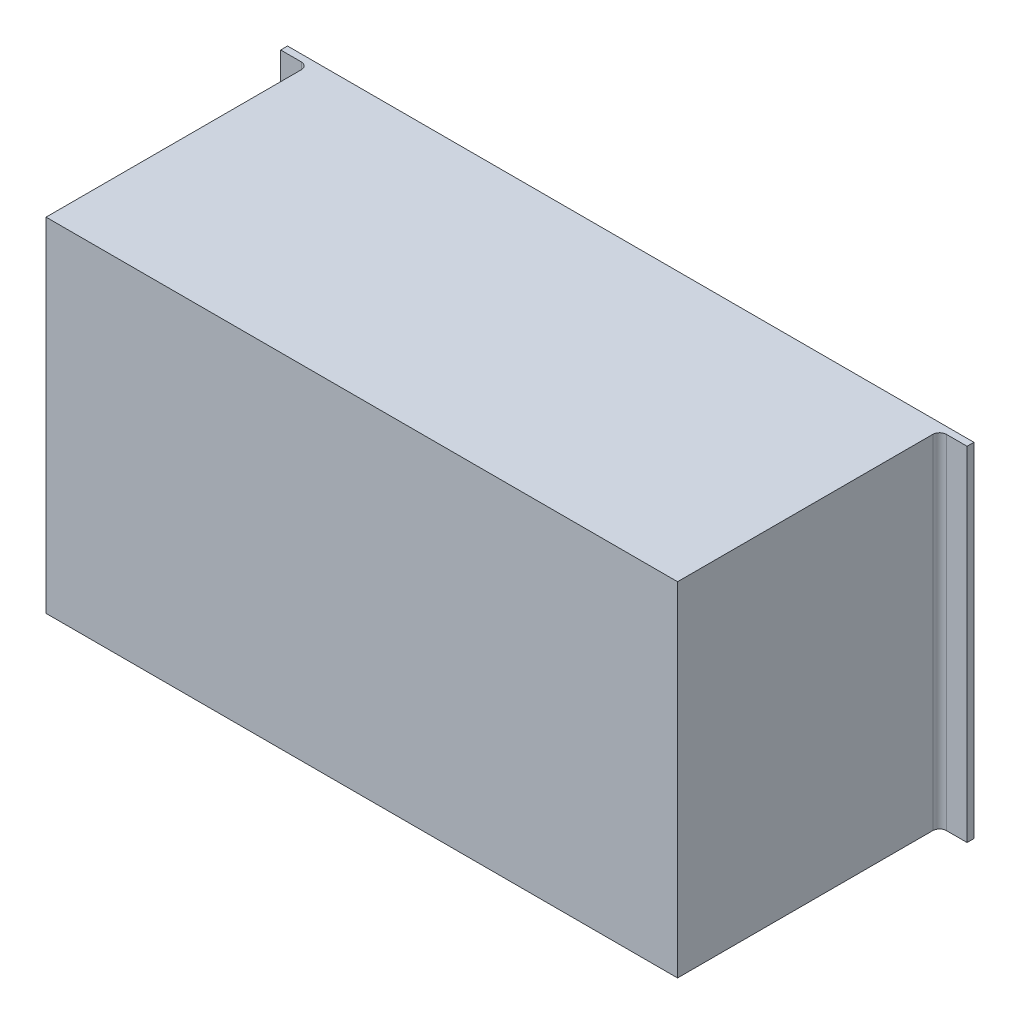
ISO-10303-21;
HEADER;
FILE_DESCRIPTION(('STEP AP214'),'2;1');
FILE_NAME('part.step','',(''),(''),'','','');
FILE_SCHEMA(('AUTOMOTIVE_DESIGN { 1 0 10303 214 1 1 1 1 }'));
ENDSEC;
DATA;
#1=APPLICATION_CONTEXT('core data for automotive mechanical design processes');
#2=APPLICATION_PROTOCOL_DEFINITION('international standard','automotive_design',2000,#1);
#3=PRODUCT_CONTEXT('',#1,'mechanical');
#4=PRODUCT('Part','Part','',(#3));
#5=PRODUCT_RELATED_PRODUCT_CATEGORY('part','',(#4));
#6=PRODUCT_DEFINITION_FORMATION('','',#4);
#7=PRODUCT_DEFINITION_CONTEXT('part definition',#1,'design');
#8=PRODUCT_DEFINITION('design','',#6,#7);
#9=PRODUCT_DEFINITION_SHAPE('','',#8);
#10=(LENGTH_UNIT() NAMED_UNIT(*) SI_UNIT(.MILLI.,.METRE.));
#11=(NAMED_UNIT(*) PLANE_ANGLE_UNIT() SI_UNIT($,.RADIAN.));
#12=(NAMED_UNIT(*) SI_UNIT($,.STERADIAN.) SOLID_ANGLE_UNIT());
#13=UNCERTAINTY_MEASURE_WITH_UNIT(LENGTH_MEASURE(1.E-05),#10,'distance_accuracy_value','');
#14=(GEOMETRIC_REPRESENTATION_CONTEXT(3) GLOBAL_UNCERTAINTY_ASSIGNED_CONTEXT((#13)) GLOBAL_UNIT_ASSIGNED_CONTEXT((#10,
#11,#12)) REPRESENTATION_CONTEXT('',''));
#15=CARTESIAN_POINT('',(0.,0.,0.));
#16=DIRECTION('',(0.,0.,1.));
#17=DIRECTION('',(1.,0.,0.));
#18=AXIS2_PLACEMENT_3D('',#15,#16,#17);
#19=CARTESIAN_POINT('',(0.,0.,-10.));
#20=DIRECTION('',(0.,0.,1.));
#21=DIRECTION('',(1.,0.,0.));
#22=AXIS2_PLACEMENT_3D('',#19,#20,#21);
#23=PLANE('',#22);
#24=DIRECTION('',(0.,1.,0.));
#25=VECTOR('',#24,1.);
#26=CARTESIAN_POINT('',(920.,0.,-10.));
#27=LINE('',#26,#25);
#28=CARTESIAN_POINT('',(920.,0.,-10.));
#29=VERTEX_POINT('',#28);
#30=CARTESIAN_POINT('',(920.,500.,-10.));
#31=VERTEX_POINT('',#30);
#32=EDGE_CURVE('E208',#29,#31,#27,.T.);
#33=ORIENTED_EDGE('',*,*,#32,.T.);
#34=DIRECTION('',(1.,0.,0.));
#35=VECTOR('',#34,1.);
#36=CARTESIAN_POINT('',(960.,500.,-10.));
#37=LINE('',#36,#35);
#38=CARTESIAN_POINT('',(960.,500.,-10.));
#39=VERTEX_POINT('',#38);
#40=EDGE_CURVE('E231',#31,#39,#37,.T.);
#41=ORIENTED_EDGE('',*,*,#40,.T.);
#42=DIRECTION('',(0.,-1.,0.));
#43=VECTOR('',#42,1.);
#44=CARTESIAN_POINT('',(960.,0.,-10.));
#45=LINE('',#44,#43);
#46=CARTESIAN_POINT('',(960.,0.,-10.));
#47=VERTEX_POINT('',#46);
#48=EDGE_CURVE('E221',#39,#47,#45,.T.);
#49=ORIENTED_EDGE('',*,*,#48,.T.);
#50=DIRECTION('',(-1.,0.,0.));
#51=VECTOR('',#50,1.);
#52=CARTESIAN_POINT('',(960.,0.,-10.));
#53=LINE('',#52,#51);
#54=EDGE_CURVE('E226',#47,#29,#53,.T.);
#55=ORIENTED_EDGE('',*,*,#54,.T.);
#56=EDGE_LOOP('',(#33,#41,#49,#55));
#57=FACE_BOUND('',#56,.T.);
#58=ADVANCED_FACE('F44',(#57),#23,.F.);
#59=CARTESIAN_POINT('',(0.,500.,380.));
#60=DIRECTION('',(0.,1.,0.));
#61=DIRECTION('',(0.,0.,1.));
#62=AXIS2_PLACEMENT_3D('',#59,#60,#61);
#63=PLANE('',#62);
#64=DIRECTION('',(0.,0.,-1.));
#65=VECTOR('',#64,1.);
#66=CARTESIAN_POINT('',(0.,500.,-9.9999));
#67=LINE('',#66,#65);
#68=CARTESIAN_POINT('',(0.,500.,-9.9999));
#69=VERTEX_POINT('',#68);
#70=CARTESIAN_POINT('',(0.,500.,-10.));
#71=VERTEX_POINT('',#70);
#72=EDGE_CURVE('E183',#69,#71,#67,.T.);
#73=ORIENTED_EDGE('',*,*,#72,.T.);
#74=CARTESIAN_POINT('',(-39.9999999999999,500.,-10.));
#75=VERTEX_POINT('',#74);
#76=EDGE_CURVE('E232',#75,#71,#37,.T.);
#77=ORIENTED_EDGE('',*,*,#76,.F.);
#78=DIRECTION('',(0.,0.,1.));
#79=VECTOR('',#78,1.);
#80=CARTESIAN_POINT('',(-39.9999999999999,500.,-10.));
#81=LINE('',#80,#79);
#82=CARTESIAN_POINT('',(-39.9999999999999,500.,0.));
#83=VERTEX_POINT('',#82);
#84=EDGE_CURVE('E249',#75,#83,#81,.T.);
#85=ORIENTED_EDGE('',*,*,#84,.T.);
#86=DIRECTION('',(1.,0.,0.));
#87=VECTOR('',#86,1.);
#88=CARTESIAN_POINT('',(960.,500.,0.));
#89=LINE('',#88,#87);
#90=CARTESIAN_POINT('',(-10.,500.,0.));
#91=VERTEX_POINT('',#90);
#92=EDGE_CURVE('E225',#83,#91,#89,.T.);
#93=ORIENTED_EDGE('',*,*,#92,.T.);
#94=CARTESIAN_POINT('',(-10.,500.,10.));
#95=DIRECTION('',(0.,1.,0.));
#96=DIRECTION('',(0.,0.,1.));
#97=AXIS2_PLACEMENT_3D('',#94,#95,#96);
#98=CIRCLE('',#97,10.);
#99=CARTESIAN_POINT('',(0.,500.,10.));
#100=VERTEX_POINT('',#99);
#101=EDGE_CURVE('E312',#91,#100,#98,.F.);
#102=ORIENTED_EDGE('',*,*,#101,.T.);
#103=DIRECTION('',(0.,0.,-1.));
#104=VECTOR('',#103,1.);
#105=CARTESIAN_POINT('',(0.,500.,380.));
#106=LINE('',#105,#104);
#107=CARTESIAN_POINT('',(0.,500.,381.8));
#108=VERTEX_POINT('',#107);
#109=EDGE_CURVE('E291',#108,#100,#106,.T.);
#110=ORIENTED_EDGE('',*,*,#109,.F.);
#111=DIRECTION('',(-1.,0.,0.));
#112=VECTOR('',#111,1.);
#113=CARTESIAN_POINT('',(0.,500.,381.8));
#114=LINE('',#113,#112);
#115=CARTESIAN_POINT('',(920.,500.,381.8));
#116=VERTEX_POINT('',#115);
#117=EDGE_CURVE('E267',#116,#108,#114,.T.);
#118=ORIENTED_EDGE('',*,*,#117,.F.);
#119=DIRECTION('',(0.,0.,-1.));
#120=VECTOR('',#119,1.);
#121=CARTESIAN_POINT('',(920.,500.,380.));
#122=LINE('',#121,#120);
#123=CARTESIAN_POINT('',(920.,500.,10.));
#124=VERTEX_POINT('',#123);
#125=EDGE_CURVE('E273',#116,#124,#122,.T.);
#126=ORIENTED_EDGE('',*,*,#125,.T.);
#127=CARTESIAN_POINT('',(930.,500.,10.));
#128=DIRECTION('',(0.,1.,0.));
#129=DIRECTION('',(0.,0.,1.));
#130=AXIS2_PLACEMENT_3D('',#127,#128,#129);
#131=CIRCLE('',#130,10.);
#132=CARTESIAN_POINT('',(930.,500.,0.));
#133=VERTEX_POINT('',#132);
#134=EDGE_CURVE('E316',#124,#133,#131,.F.);
#135=ORIENTED_EDGE('',*,*,#134,.T.);
#136=CARTESIAN_POINT('',(960.,500.,0.));
#137=VERTEX_POINT('',#136);
#138=EDGE_CURVE('E244',#133,#137,#89,.T.);
#139=ORIENTED_EDGE('',*,*,#138,.T.);
#140=DIRECTION('',(0.,0.,1.));
#141=VECTOR('',#140,1.);
#142=CARTESIAN_POINT('',(960.,500.,-10.));
#143=LINE('',#142,#141);
#144=EDGE_CURVE('E234',#39,#137,#143,.T.);
#145=ORIENTED_EDGE('',*,*,#144,.F.);
#146=ORIENTED_EDGE('',*,*,#40,.F.);
#147=DIRECTION('',(0.,0.,-1.));
#148=VECTOR('',#147,1.);
#149=CARTESIAN_POINT('',(920.,500.,-9.9999));
#150=LINE('',#149,#148);
#151=CARTESIAN_POINT('',(920.,500.,-9.9999));
#152=VERTEX_POINT('',#151);
#153=EDGE_CURVE('E62',#152,#31,#150,.T.);
#154=ORIENTED_EDGE('',*,*,#153,.F.);
#155=DIRECTION('',(-1.,0.,0.));
#156=VECTOR('',#155,1.);
#157=CARTESIAN_POINT('',(920.,500.,-9.9999));
#158=LINE('',#157,#156);
#159=EDGE_CURVE('E201',#152,#69,#158,.T.);
#160=ORIENTED_EDGE('',*,*,#159,.T.);
#161=EDGE_LOOP('',(#73,#77,#85,#93,#102,#110,#118,#126,#135,#139,#145,#146,#154,#160));
#162=FACE_BOUND('',#161,.T.);
#163=ADVANCED_FACE('F206',(#162),#63,.T.);
#164=CARTESIAN_POINT('',(0.,0.,380.));
#165=DIRECTION('',(-1.,0.,0.));
#166=DIRECTION('',(0.,0.,1.));
#167=AXIS2_PLACEMENT_3D('',#164,#165,#166);
#168=PLANE('',#167);
#169=ORIENTED_EDGE('',*,*,#109,.T.);
#170=DIRECTION('',(0.,1.,0.));
#171=VECTOR('',#170,1.);
#172=CARTESIAN_POINT('',(0.,0.,10.));
#173=LINE('',#172,#171);
#174=CARTESIAN_POINT('',(0.,0.,10.));
#175=VERTEX_POINT('',#174);
#176=EDGE_CURVE('E305',#100,#175,#173,.F.);
#177=ORIENTED_EDGE('',*,*,#176,.T.);
#178=DIRECTION('',(0.,0.,-1.));
#179=VECTOR('',#178,1.);
#180=CARTESIAN_POINT('',(0.,0.,380.));
#181=LINE('',#180,#179);
#182=CARTESIAN_POINT('',(0.,0.,381.8));
#183=VERTEX_POINT('',#182);
#184=EDGE_CURVE('E295',#183,#175,#181,.T.);
#185=ORIENTED_EDGE('',*,*,#184,.F.);
#186=DIRECTION('',(0.,-1.,0.));
#187=VECTOR('',#186,1.);
#188=CARTESIAN_POINT('',(0.,0.,381.8));
#189=LINE('',#188,#187);
#190=EDGE_CURVE('E258',#108,#183,#189,.T.);
#191=ORIENTED_EDGE('',*,*,#190,.F.);
#192=EDGE_LOOP('',(#169,#177,#185,#191));
#193=FACE_BOUND('',#192,.T.);
#194=ADVANCED_FACE('F390',(#193),#168,.T.);
#195=CARTESIAN_POINT('',(0.,0.,380.));
#196=DIRECTION('',(0.,1.,0.));
#197=DIRECTION('',(0.,0.,1.));
#198=AXIS2_PLACEMENT_3D('',#195,#196,#197);
#199=PLANE('',#198);
#200=CARTESIAN_POINT('',(1.11022302462516E-13,0.,-10.));
#201=VERTEX_POINT('',#200);
#202=CARTESIAN_POINT('',(-39.9999999999999,0.,-10.));
#203=VERTEX_POINT('',#202);
#204=EDGE_CURVE('E224',#201,#203,#53,.T.);
#205=ORIENTED_EDGE('',*,*,#204,.F.);
#206=DIRECTION('',(0.,0.,-1.));
#207=VECTOR('',#206,1.);
#208=CARTESIAN_POINT('',(1.11022302462516E-13,0.,-9.9999));
#209=LINE('',#208,#207);
#210=CARTESIAN_POINT('',(1.11022302462516E-13,0.,-9.9999));
#211=VERTEX_POINT('',#210);
#212=EDGE_CURVE('E195',#211,#201,#209,.T.);
#213=ORIENTED_EDGE('',*,*,#212,.F.);
#214=DIRECTION('',(-1.,0.,0.));
#215=VECTOR('',#214,1.);
#216=CARTESIAN_POINT('',(920.,0.,-9.9999));
#217=LINE('',#216,#215);
#218=CARTESIAN_POINT('',(920.,0.,-9.9999));
#219=VERTEX_POINT('',#218);
#220=EDGE_CURVE('E203',#219,#211,#217,.T.);
#221=ORIENTED_EDGE('',*,*,#220,.F.);
#222=DIRECTION('',(0.,0.,-1.));
#223=VECTOR('',#222,1.);
#224=CARTESIAN_POINT('',(920.,0.,-9.9999));
#225=LINE('',#224,#223);
#226=EDGE_CURVE('E217',#219,#29,#225,.T.);
#227=ORIENTED_EDGE('',*,*,#226,.T.);
#228=ORIENTED_EDGE('',*,*,#54,.F.);
#229=DIRECTION('',(0.,0.,1.));
#230=VECTOR('',#229,1.);
#231=CARTESIAN_POINT('',(960.,0.,-10.));
#232=LINE('',#231,#230);
#233=CARTESIAN_POINT('',(960.,0.,0.));
#234=VERTEX_POINT('',#233);
#235=EDGE_CURVE('E255',#47,#234,#232,.T.);
#236=ORIENTED_EDGE('',*,*,#235,.T.);
#237=DIRECTION('',(-1.,0.,0.));
#238=VECTOR('',#237,1.);
#239=CARTESIAN_POINT('',(960.,0.,0.));
#240=LINE('',#239,#238);
#241=CARTESIAN_POINT('',(930.,0.,0.));
#242=VERTEX_POINT('',#241);
#243=EDGE_CURVE('E239',#234,#242,#240,.T.);
#244=ORIENTED_EDGE('',*,*,#243,.T.);
#245=CARTESIAN_POINT('',(930.,0.,10.));
#246=DIRECTION('',(0.,1.,0.));
#247=DIRECTION('',(0.,0.,1.));
#248=AXIS2_PLACEMENT_3D('',#245,#246,#247);
#249=CIRCLE('',#248,10.);
#250=CARTESIAN_POINT('',(920.,0.,10.));
#251=VERTEX_POINT('',#250);
#252=EDGE_CURVE('E318',#242,#251,#249,.T.);
#253=ORIENTED_EDGE('',*,*,#252,.T.);
#254=DIRECTION('',(0.,0.,-1.));
#255=VECTOR('',#254,1.);
#256=CARTESIAN_POINT('',(920.,0.,380.));
#257=LINE('',#256,#255);
#258=CARTESIAN_POINT('',(920.,0.,381.8));
#259=VERTEX_POINT('',#258);
#260=EDGE_CURVE('E298',#259,#251,#257,.T.);
#261=ORIENTED_EDGE('',*,*,#260,.F.);
#262=DIRECTION('',(1.,0.,0.));
#263=VECTOR('',#262,1.);
#264=CARTESIAN_POINT('',(0.,0.,381.8));
#265=LINE('',#264,#263);
#266=EDGE_CURVE('E261',#183,#259,#265,.T.);
#267=ORIENTED_EDGE('',*,*,#266,.F.);
#268=ORIENTED_EDGE('',*,*,#184,.T.);
#269=CARTESIAN_POINT('',(-10.,0.,10.));
#270=DIRECTION('',(0.,1.,0.));
#271=DIRECTION('',(0.,0.,1.));
#272=AXIS2_PLACEMENT_3D('',#269,#270,#271);
#273=CIRCLE('',#272,10.);
#274=CARTESIAN_POINT('',(-10.,0.,0.));
#275=VERTEX_POINT('',#274);
#276=EDGE_CURVE('E314',#175,#275,#273,.T.);
#277=ORIENTED_EDGE('',*,*,#276,.T.);
#278=CARTESIAN_POINT('',(-39.9999999999999,0.,0.));
#279=VERTEX_POINT('',#278);
#280=EDGE_CURVE('E238',#275,#279,#240,.T.);
#281=ORIENTED_EDGE('',*,*,#280,.T.);
#282=DIRECTION('',(0.,0.,1.));
#283=VECTOR('',#282,1.);
#284=CARTESIAN_POINT('',(-39.9999999999999,0.,-10.));
#285=LINE('',#284,#283);
#286=EDGE_CURVE('E252',#203,#279,#285,.T.);
#287=ORIENTED_EDGE('',*,*,#286,.F.);
#288=EDGE_LOOP('',(#205,#213,#221,#227,#228,#236,#244,#253,#261,#267,#268,#277,#281,#287));
#289=FACE_BOUND('',#288,.T.);
#290=ADVANCED_FACE('F393',(#289),#199,.F.);
#291=CARTESIAN_POINT('',(920.,0.,380.));
#292=DIRECTION('',(-1.,0.,0.));
#293=DIRECTION('',(0.,0.,1.));
#294=AXIS2_PLACEMENT_3D('',#291,#292,#293);
#295=PLANE('',#294);
#296=ORIENTED_EDGE('',*,*,#260,.T.);
#297=DIRECTION('',(0.,1.,0.));
#298=VECTOR('',#297,1.);
#299=CARTESIAN_POINT('',(920.,0.,10.));
#300=LINE('',#299,#298);
#301=EDGE_CURVE('E307',#251,#124,#300,.T.);
#302=ORIENTED_EDGE('',*,*,#301,.T.);
#303=ORIENTED_EDGE('',*,*,#125,.F.);
#304=DIRECTION('',(0.,1.,0.));
#305=VECTOR('',#304,1.);
#306=CARTESIAN_POINT('',(920.,0.,381.8));
#307=LINE('',#306,#305);
#308=EDGE_CURVE('E264',#259,#116,#307,.T.);
#309=ORIENTED_EDGE('',*,*,#308,.F.);
#310=EDGE_LOOP('',(#296,#302,#303,#309));
#311=FACE_BOUND('',#310,.T.);
#312=ADVANCED_FACE('F397',(#311),#295,.F.);
#313=CARTESIAN_POINT('',(0.,0.,381.8));
#314=DIRECTION('',(0.,0.,-1.));
#315=DIRECTION('',(-1.,0.,0.));
#316=AXIS2_PLACEMENT_3D('',#313,#314,#315);
#317=PLANE('',#316);
#318=ORIENTED_EDGE('',*,*,#190,.T.);
#319=ORIENTED_EDGE('',*,*,#266,.T.);
#320=ORIENTED_EDGE('',*,*,#308,.T.);
#321=ORIENTED_EDGE('',*,*,#117,.T.);
#322=EDGE_LOOP('',(#318,#319,#320,#321));
#323=FACE_BOUND('',#322,.T.);
#324=ADVANCED_FACE('F401',(#323),#317,.F.);
#325=CARTESIAN_POINT('',(0.,0.,0.));
#326=DIRECTION('',(0.,0.,1.));
#327=DIRECTION('',(1.,0.,0.));
#328=AXIS2_PLACEMENT_3D('',#325,#326,#327);
#329=PLANE('',#328);
#330=ORIENTED_EDGE('',*,*,#138,.F.);
#331=DIRECTION('',(0.,1.,0.));
#332=VECTOR('',#331,1.);
#333=CARTESIAN_POINT('',(930.,0.,0.));
#334=LINE('',#333,#332);
#335=EDGE_CURVE('E310',#133,#242,#334,.F.);
#336=ORIENTED_EDGE('',*,*,#335,.T.);
#337=ORIENTED_EDGE('',*,*,#243,.F.);
#338=DIRECTION('',(0.,-1.,0.));
#339=VECTOR('',#338,1.);
#340=CARTESIAN_POINT('',(960.,0.,0.));
#341=LINE('',#340,#339);
#342=EDGE_CURVE('E235',#137,#234,#341,.T.);
#343=ORIENTED_EDGE('',*,*,#342,.F.);
#344=EDGE_LOOP('',(#330,#336,#337,#343));
#345=FACE_BOUND('',#344,.T.);
#346=ADVANCED_FACE('F516',(#345),#329,.T.);
#347=CARTESIAN_POINT('',(960.,0.,-10.));
#348=DIRECTION('',(-1.,0.,0.));
#349=DIRECTION('',(0.,0.,1.));
#350=AXIS2_PLACEMENT_3D('',#347,#348,#349);
#351=PLANE('',#350);
#352=ORIENTED_EDGE('',*,*,#342,.T.);
#353=ORIENTED_EDGE('',*,*,#235,.F.);
#354=ORIENTED_EDGE('',*,*,#48,.F.);
#355=ORIENTED_EDGE('',*,*,#144,.T.);
#356=EDGE_LOOP('',(#352,#353,#354,#355));
#357=FACE_BOUND('',#356,.T.);
#358=ADVANCED_FACE('F532',(#357),#351,.F.);
#359=CARTESIAN_POINT('',(-39.9999999999999,0.,-10.));
#360=DIRECTION('',(1.,0.,0.));
#361=DIRECTION('',(0.,0.,-1.));
#362=AXIS2_PLACEMENT_3D('',#359,#360,#361);
#363=PLANE('',#362);
#364=DIRECTION('',(0.,1.,0.));
#365=VECTOR('',#364,1.);
#366=CARTESIAN_POINT('',(-39.9999999999999,0.,0.));
#367=LINE('',#366,#365);
#368=EDGE_CURVE('E242',#279,#83,#367,.T.);
#369=ORIENTED_EDGE('',*,*,#368,.T.);
#370=ORIENTED_EDGE('',*,*,#84,.F.);
#371=DIRECTION('',(0.,1.,0.));
#372=VECTOR('',#371,1.);
#373=CARTESIAN_POINT('',(-39.9999999999999,0.,-10.));
#374=LINE('',#373,#372);
#375=EDGE_CURVE('E229',#203,#75,#374,.T.);
#376=ORIENTED_EDGE('',*,*,#375,.F.);
#377=ORIENTED_EDGE('',*,*,#286,.T.);
#378=EDGE_LOOP('',(#369,#370,#376,#377));
#379=FACE_BOUND('',#378,.T.);
#380=ADVANCED_FACE('F523',(#379),#363,.F.);
#381=ORIENTED_EDGE('',*,*,#76,.T.);
#382=DIRECTION('',(0.,1.,0.));
#383=VECTOR('',#382,1.);
#384=CARTESIAN_POINT('',(1.11022302462516E-13,0.,-10.));
#385=LINE('',#384,#383);
#386=EDGE_CURVE('E189',#201,#71,#385,.T.);
#387=ORIENTED_EDGE('',*,*,#386,.F.);
#388=ORIENTED_EDGE('',*,*,#204,.T.);
#389=ORIENTED_EDGE('',*,*,#375,.T.);
#390=EDGE_LOOP('',(#381,#387,#388,#389));
#391=FACE_BOUND('',#390,.T.);
#392=ADVANCED_FACE('F437',(#391),#23,.F.);
#393=ORIENTED_EDGE('',*,*,#280,.F.);
#394=DIRECTION('',(0.,1.,0.));
#395=VECTOR('',#394,1.);
#396=CARTESIAN_POINT('',(-10.,500.,0.));
#397=LINE('',#396,#395);
#398=EDGE_CURVE('E294',#275,#91,#397,.T.);
#399=ORIENTED_EDGE('',*,*,#398,.T.);
#400=ORIENTED_EDGE('',*,*,#92,.F.);
#401=ORIENTED_EDGE('',*,*,#368,.F.);
#402=EDGE_LOOP('',(#393,#399,#400,#401));
#403=FACE_BOUND('',#402,.T.);
#404=ADVANCED_FACE('F409',(#403),#329,.T.);
#405=CARTESIAN_POINT('',(-10.,0.,10.));
#406=DIRECTION('',(0.,-1.,0.));
#407=DIRECTION('',(0.,0.,-1.));
#408=AXIS2_PLACEMENT_3D('',#405,#406,#407);
#409=CYLINDRICAL_SURFACE('',#408,10.);
#410=ORIENTED_EDGE('',*,*,#276,.F.);
#411=ORIENTED_EDGE('',*,*,#176,.F.);
#412=ORIENTED_EDGE('',*,*,#101,.F.);
#413=ORIENTED_EDGE('',*,*,#398,.F.);
#414=EDGE_LOOP('',(#410,#411,#412,#413));
#415=FACE_BOUND('',#414,.T.);
#416=ADVANCED_FACE('F405',(#415),#409,.F.);
#417=CARTESIAN_POINT('',(930.,0.,10.));
#418=DIRECTION('',(0.,1.,0.));
#419=DIRECTION('',(0.,0.,1.));
#420=AXIS2_PLACEMENT_3D('',#417,#418,#419);
#421=CYLINDRICAL_SURFACE('',#420,10.);
#422=ORIENTED_EDGE('',*,*,#252,.F.);
#423=ORIENTED_EDGE('',*,*,#335,.F.);
#424=ORIENTED_EDGE('',*,*,#134,.F.);
#425=ORIENTED_EDGE('',*,*,#301,.F.);
#426=EDGE_LOOP('',(#422,#423,#424,#425));
#427=FACE_BOUND('',#426,.T.);
#428=ADVANCED_FACE('F408',(#427),#421,.F.);
#429=CARTESIAN_POINT('',(1.11022302462516E-13,0.,-9.9999));
#430=DIRECTION('',(-1.,0.,0.));
#431=DIRECTION('',(0.,-1.,0.));
#432=AXIS2_PLACEMENT_3D('',#429,#430,#431);
#433=PLANE('',#432);
#434=ORIENTED_EDGE('',*,*,#386,.T.);
#435=ORIENTED_EDGE('',*,*,#72,.F.);
#436=DIRECTION('',(0.,1.,0.));
#437=VECTOR('',#436,1.);
#438=CARTESIAN_POINT('',(1.11022302462516E-13,0.,-9.9999));
#439=LINE('',#438,#437);
#440=EDGE_CURVE('E186',#211,#69,#439,.T.);
#441=ORIENTED_EDGE('',*,*,#440,.F.);
#442=ORIENTED_EDGE('',*,*,#212,.T.);
#443=EDGE_LOOP('',(#434,#435,#441,#442));
#444=FACE_BOUND('',#443,.T.);
#445=ADVANCED_FACE('F185',(#444),#433,.F.);
#446=CARTESIAN_POINT('',(920.,0.,-9.9999));
#447=DIRECTION('',(-1.,0.,0.));
#448=DIRECTION('',(0.,0.,1.));
#449=AXIS2_PLACEMENT_3D('',#446,#447,#448);
#450=PLANE('',#449);
#451=ORIENTED_EDGE('',*,*,#32,.F.);
#452=ORIENTED_EDGE('',*,*,#226,.F.);
#453=DIRECTION('',(0.,1.,0.));
#454=VECTOR('',#453,1.);
#455=CARTESIAN_POINT('',(920.,0.,-9.9999));
#456=LINE('',#455,#454);
#457=EDGE_CURVE('E213',#219,#152,#456,.T.);
#458=ORIENTED_EDGE('',*,*,#457,.T.);
#459=ORIENTED_EDGE('',*,*,#153,.T.);
#460=EDGE_LOOP('',(#451,#452,#458,#459));
#461=FACE_BOUND('',#460,.T.);
#462=ADVANCED_FACE('F445',(#461),#450,.T.);
#463=CARTESIAN_POINT('',(0.,0.,-9.9999));
#464=DIRECTION('',(0.,0.,-1.));
#465=DIRECTION('',(-1.,0.,0.));
#466=AXIS2_PLACEMENT_3D('',#463,#464,#465);
#467=PLANE('',#466);
#468=ORIENTED_EDGE('',*,*,#159,.F.);
#469=ORIENTED_EDGE('',*,*,#457,.F.);
#470=ORIENTED_EDGE('',*,*,#220,.T.);
#471=ORIENTED_EDGE('',*,*,#440,.T.);
#472=EDGE_LOOP('',(#468,#469,#470,#471));
#473=FACE_BOUND('',#472,.T.);
#474=ADVANCED_FACE('F199',(#473),#467,.T.);
#475=CLOSED_SHELL('',(#58,#163,#194,#290,#312,#324,#346,#358,#380,#392,#404,#416,#428,#445,#462,#474));
#476=CARTESIAN_POINT('',(0.,0.6,380.));
#477=DIRECTION('',(0.,1.,0.));
#478=DIRECTION('',(0.,0.,1.));
#479=AXIS2_PLACEMENT_3D('',#476,#477,#478);
#480=PLANE('',#479);
#481=DIRECTION('',(0.,0.,-1.));
#482=VECTOR('',#481,1.);
#483=CARTESIAN_POINT('',(919.4,0.6,380.));
#484=LINE('',#483,#482);
#485=CARTESIAN_POINT('',(919.4,0.6,380.));
#486=VERTEX_POINT('',#485);
#487=CARTESIAN_POINT('',(919.4,0.6,15.6));
#488=VERTEX_POINT('',#487);
#489=EDGE_CURVE('E277',#486,#488,#484,.T.);
#490=ORIENTED_EDGE('',*,*,#489,.T.);
#491=DIRECTION('',(1.,0.,0.));
#492=VECTOR('',#491,1.);
#493=CARTESIAN_POINT('',(0.6,0.6,15.6));
#494=LINE('',#493,#492);
#495=CARTESIAN_POINT('',(0.6,0.6,15.6));
#496=VERTEX_POINT('',#495);
#497=EDGE_CURVE('E329',#488,#496,#494,.F.);
#498=ORIENTED_EDGE('',*,*,#497,.T.);
#499=DIRECTION('',(0.,0.,-1.));
#500=VECTOR('',#499,1.);
#501=CARTESIAN_POINT('',(0.6,0.6,380.));
#502=LINE('',#501,#500);
#503=CARTESIAN_POINT('',(0.6,0.6,380.));
#504=VERTEX_POINT('',#503);
#505=EDGE_CURVE('E274',#504,#496,#502,.T.);
#506=ORIENTED_EDGE('',*,*,#505,.F.);
#507=DIRECTION('',(1.,0.,0.));
#508=VECTOR('',#507,1.);
#509=CARTESIAN_POINT('',(0.,0.6,380.));
#510=LINE('',#509,#508);
#511=EDGE_CURVE('E286',#504,#486,#510,.T.);
#512=ORIENTED_EDGE('',*,*,#511,.T.);
#513=EDGE_LOOP('',(#490,#498,#506,#512));
#514=FACE_BOUND('',#513,.T.);
#515=ADVANCED_FACE('F359',(#514),#480,.T.);
#516=CARTESIAN_POINT('',(919.4,0.,380.));
#517=DIRECTION('',(-1.,0.,0.));
#518=DIRECTION('',(0.,0.,1.));
#519=AXIS2_PLACEMENT_3D('',#516,#517,#518);
#520=PLANE('',#519);
#521=DIRECTION('',(0.,0.,-1.));
#522=VECTOR('',#521,1.);
#523=CARTESIAN_POINT('',(919.4,499.4,380.));
#524=LINE('',#523,#522);
#525=CARTESIAN_POINT('',(919.4,499.4,380.));
#526=VERTEX_POINT('',#525);
#527=CARTESIAN_POINT('',(919.4,499.4,15.6));
#528=VERTEX_POINT('',#527);
#529=EDGE_CURVE('E275',#526,#528,#524,.T.);
#530=ORIENTED_EDGE('',*,*,#529,.T.);
#531=DIRECTION('',(0.,1.,0.));
#532=VECTOR('',#531,1.);
#533=CARTESIAN_POINT('',(919.4,0.6,15.6));
#534=LINE('',#533,#532);
#535=EDGE_CURVE('E11',#528,#488,#534,.F.);
#536=ORIENTED_EDGE('',*,*,#535,.T.);
#537=ORIENTED_EDGE('',*,*,#489,.F.);
#538=DIRECTION('',(0.,1.,0.));
#539=VECTOR('',#538,1.);
#540=CARTESIAN_POINT('',(919.4,0.,380.));
#541=LINE('',#540,#539);
#542=EDGE_CURVE('E284',#486,#526,#541,.T.);
#543=ORIENTED_EDGE('',*,*,#542,.T.);
#544=EDGE_LOOP('',(#530,#536,#537,#543));
#545=FACE_BOUND('',#544,.T.);
#546=ADVANCED_FACE('F356',(#545),#520,.T.);
#547=CARTESIAN_POINT('',(0.,499.4,380.));
#548=DIRECTION('',(0.,1.,0.));
#549=DIRECTION('',(0.,0.,1.));
#550=AXIS2_PLACEMENT_3D('',#547,#548,#549);
#551=PLANE('',#550);
#552=DIRECTION('',(0.,0.,-1.));
#553=VECTOR('',#552,1.);
#554=CARTESIAN_POINT('',(0.6,499.4,380.));
#555=LINE('',#554,#553);
#556=CARTESIAN_POINT('',(0.6,499.4,380.));
#557=VERTEX_POINT('',#556);
#558=CARTESIAN_POINT('',(0.6,499.4,15.6));
#559=VERTEX_POINT('',#558);
#560=EDGE_CURVE('E271',#557,#559,#555,.T.);
#561=ORIENTED_EDGE('',*,*,#560,.T.);
#562=DIRECTION('',(-1.,0.,0.));
#563=VECTOR('',#562,1.);
#564=CARTESIAN_POINT('',(0.,499.4,15.6));
#565=LINE('',#564,#563);
#566=EDGE_CURVE('E54',#559,#528,#565,.F.);
#567=ORIENTED_EDGE('',*,*,#566,.T.);
#568=ORIENTED_EDGE('',*,*,#529,.F.);
#569=DIRECTION('',(1.,0.,0.));
#570=VECTOR('',#569,1.);
#571=CARTESIAN_POINT('',(0.,499.4,380.));
#572=LINE('',#571,#570);
#573=EDGE_CURVE('E270',#557,#526,#572,.T.);
#574=ORIENTED_EDGE('',*,*,#573,.F.);
#575=EDGE_LOOP('',(#561,#567,#568,#574));
#576=FACE_BOUND('',#575,.T.);
#577=ADVANCED_FACE('F385',(#576),#551,.F.);
#578=CARTESIAN_POINT('',(0.6,0.,380.));
#579=DIRECTION('',(-1.,0.,0.));
#580=DIRECTION('',(0.,0.,1.));
#581=AXIS2_PLACEMENT_3D('',#578,#579,#580);
#582=PLANE('',#581);
#583=ORIENTED_EDGE('',*,*,#505,.T.);
#584=DIRECTION('',(0.,-1.,0.));
#585=VECTOR('',#584,1.);
#586=CARTESIAN_POINT('',(0.6,0.,15.6));
#587=LINE('',#586,#585);
#588=EDGE_CURVE('E332',#496,#559,#587,.F.);
#589=ORIENTED_EDGE('',*,*,#588,.T.);
#590=ORIENTED_EDGE('',*,*,#560,.F.);
#591=DIRECTION('',(0.,1.,0.));
#592=VECTOR('',#591,1.);
#593=CARTESIAN_POINT('',(0.6,0.,380.));
#594=LINE('',#593,#592);
#595=EDGE_CURVE('E278',#504,#557,#594,.T.);
#596=ORIENTED_EDGE('',*,*,#595,.F.);
#597=EDGE_LOOP('',(#583,#589,#590,#596));
#598=FACE_BOUND('',#597,.T.);
#599=ADVANCED_FACE('F374',(#598),#582,.F.);
#600=CARTESIAN_POINT('',(0.,0.,380.));
#601=DIRECTION('',(0.,0.,-1.));
#602=DIRECTION('',(-1.,0.,0.));
#603=AXIS2_PLACEMENT_3D('',#600,#601,#602);
#604=PLANE('',#603);
#605=ORIENTED_EDGE('',*,*,#511,.F.);
#606=ORIENTED_EDGE('',*,*,#595,.T.);
#607=ORIENTED_EDGE('',*,*,#573,.T.);
#608=ORIENTED_EDGE('',*,*,#542,.F.);
#609=EDGE_LOOP('',(#605,#606,#607,#608));
#610=FACE_BOUND('',#609,.T.);
#611=ADVANCED_FACE('F367',(#610),#604,.T.);
#612=CARTESIAN_POINT('',(0.,0.,-4.4));
#613=DIRECTION('',(0.,0.,1.));
#614=DIRECTION('',(1.,0.,0.));
#615=AXIS2_PLACEMENT_3D('',#612,#613,#614);
#616=PLANE('',#615);
#617=DIRECTION('',(0.,-1.,0.));
#618=VECTOR('',#617,1.);
#619=CARTESIAN_POINT('',(20.6,0.,-4.4));
#620=LINE('',#619,#618);
#621=CARTESIAN_POINT('',(20.6,479.4,-4.4));
#622=VERTEX_POINT('',#621);
#623=CARTESIAN_POINT('',(20.6,20.6,-4.4));
#624=VERTEX_POINT('',#623);
#625=EDGE_CURVE('E324',#622,#624,#620,.T.);
#626=ORIENTED_EDGE('',*,*,#625,.T.);
#627=DIRECTION('',(1.,0.,0.));
#628=VECTOR('',#627,1.);
#629=CARTESIAN_POINT('',(919.4,20.6,-4.4));
#630=LINE('',#629,#628);
#631=CARTESIAN_POINT('',(899.4,20.6,-4.4));
#632=VERTEX_POINT('',#631);
#633=EDGE_CURVE('E326',#624,#632,#630,.T.);
#634=ORIENTED_EDGE('',*,*,#633,.T.);
#635=DIRECTION('',(0.,1.,0.));
#636=VECTOR('',#635,1.);
#637=CARTESIAN_POINT('',(899.4,499.4,-4.4));
#638=LINE('',#637,#636);
#639=CARTESIAN_POINT('',(899.4,479.4,-4.4));
#640=VERTEX_POINT('',#639);
#641=EDGE_CURVE('E320',#632,#640,#638,.T.);
#642=ORIENTED_EDGE('',*,*,#641,.T.);
#643=DIRECTION('',(-1.,0.,0.));
#644=VECTOR('',#643,1.);
#645=CARTESIAN_POINT('',(0.,479.4,-4.4));
#646=LINE('',#645,#644);
#647=EDGE_CURVE('E322',#640,#622,#646,.T.);
#648=ORIENTED_EDGE('',*,*,#647,.T.);
#649=EDGE_LOOP('',(#626,#634,#642,#648));
#650=FACE_BOUND('',#649,.T.);
#651=ADVANCED_FACE('F365',(#650),#616,.T.);
#652=CARTESIAN_POINT('',(0.,479.4,15.6));
#653=DIRECTION('',(-1.,0.,0.));
#654=DIRECTION('',(0.,0.,1.));
#655=AXIS2_PLACEMENT_3D('',#652,#653,#654);
#656=CYLINDRICAL_SURFACE('',#655,20.);
#657=CARTESIAN_POINT('',(899.4,479.4,15.6));
#658=DIRECTION('',(-0.707106781186547,0.707106781186547,0.));
#659=DIRECTION('',(-0.707106781186547,-0.707106781186547,0.));
#660=AXIS2_PLACEMENT_3D('',#657,#658,#659);
#661=ELLIPSE('',#660,28.2842712474619,20.);
#662=EDGE_CURVE('E337',#528,#640,#661,.T.);
#663=ORIENTED_EDGE('',*,*,#662,.F.);
#664=ORIENTED_EDGE('',*,*,#566,.F.);
#665=CARTESIAN_POINT('',(20.6,479.4,15.6));
#666=DIRECTION('',(-0.707106781186547,-0.707106781186547,0.));
#667=DIRECTION('',(0.707106781186547,-0.707106781186547,0.));
#668=AXIS2_PLACEMENT_3D('',#665,#666,#667);
#669=ELLIPSE('',#668,28.2842712474619,20.);
#670=EDGE_CURVE('E48',#622,#559,#669,.F.);
#671=ORIENTED_EDGE('',*,*,#670,.F.);
#672=ORIENTED_EDGE('',*,*,#647,.F.);
#673=EDGE_LOOP('',(#663,#664,#671,#672));
#674=FACE_BOUND('',#673,.T.);
#675=ADVANCED_FACE('F46',(#674),#656,.F.);
#676=CARTESIAN_POINT('',(20.6,0.,15.6));
#677=DIRECTION('',(0.,-1.,0.));
#678=DIRECTION('',(0.,0.,-1.));
#679=AXIS2_PLACEMENT_3D('',#676,#677,#678);
#680=CYLINDRICAL_SURFACE('',#679,20.);
#681=ORIENTED_EDGE('',*,*,#670,.T.);
#682=ORIENTED_EDGE('',*,*,#588,.F.);
#683=CARTESIAN_POINT('',(20.6,20.6,15.6));
#684=DIRECTION('',(-0.707106781186547,0.707106781186547,0.));
#685=DIRECTION('',(-0.707106781186547,-0.707106781186547,0.));
#686=AXIS2_PLACEMENT_3D('',#683,#684,#685);
#687=ELLIPSE('',#686,28.2842712474619,20.);
#688=EDGE_CURVE('E336',#624,#496,#687,.T.);
#689=ORIENTED_EDGE('',*,*,#688,.F.);
#690=ORIENTED_EDGE('',*,*,#625,.F.);
#691=EDGE_LOOP('',(#681,#682,#689,#690));
#692=FACE_BOUND('',#691,.T.);
#693=ADVANCED_FACE('F348',(#692),#680,.F.);
#694=CARTESIAN_POINT('',(899.4,0.,15.6));
#695=DIRECTION('',(0.,-1.,0.));
#696=DIRECTION('',(0.,0.,-1.));
#697=AXIS2_PLACEMENT_3D('',#694,#695,#696);
#698=CYLINDRICAL_SURFACE('',#697,20.);
#699=ORIENTED_EDGE('',*,*,#662,.T.);
#700=ORIENTED_EDGE('',*,*,#641,.F.);
#701=CARTESIAN_POINT('',(899.4,20.6,15.6));
#702=DIRECTION('',(-0.707106781186547,-0.707106781186547,0.));
#703=DIRECTION('',(-0.707106781186547,0.707106781186547,0.));
#704=AXIS2_PLACEMENT_3D('',#701,#702,#703);
#705=ELLIPSE('',#704,28.2842712474619,20.);
#706=EDGE_CURVE('E194',#488,#632,#705,.F.);
#707=ORIENTED_EDGE('',*,*,#706,.F.);
#708=ORIENTED_EDGE('',*,*,#535,.F.);
#709=EDGE_LOOP('',(#699,#700,#707,#708));
#710=FACE_BOUND('',#709,.T.);
#711=ADVANCED_FACE('F353',(#710),#698,.F.);
#712=CARTESIAN_POINT('',(0.,20.6,15.6));
#713=DIRECTION('',(-1.,0.,0.));
#714=DIRECTION('',(0.,0.,1.));
#715=AXIS2_PLACEMENT_3D('',#712,#713,#714);
#716=CYLINDRICAL_SURFACE('',#715,20.);
#717=ORIENTED_EDGE('',*,*,#688,.T.);
#718=ORIENTED_EDGE('',*,*,#497,.F.);
#719=ORIENTED_EDGE('',*,*,#706,.T.);
#720=ORIENTED_EDGE('',*,*,#633,.F.);
#721=EDGE_LOOP('',(#717,#718,#719,#720));
#722=FACE_BOUND('',#721,.T.);
#723=ADVANCED_FACE('F362',(#722),#716,.F.);
#724=CLOSED_SHELL('',(#515,#546,#577,#599,#611,#651,#675,#693,#711,#723));
#725=ORIENTED_CLOSED_SHELL('',*,#724,.T.);
#726=BREP_WITH_VOIDS('B2',#475,(#725));
#727=ADVANCED_BREP_SHAPE_REPRESENTATION('',(#18,#726),#14);
#728=SHAPE_DEFINITION_REPRESENTATION(#9,#727);
ENDSEC;
END-ISO-10303-21;
